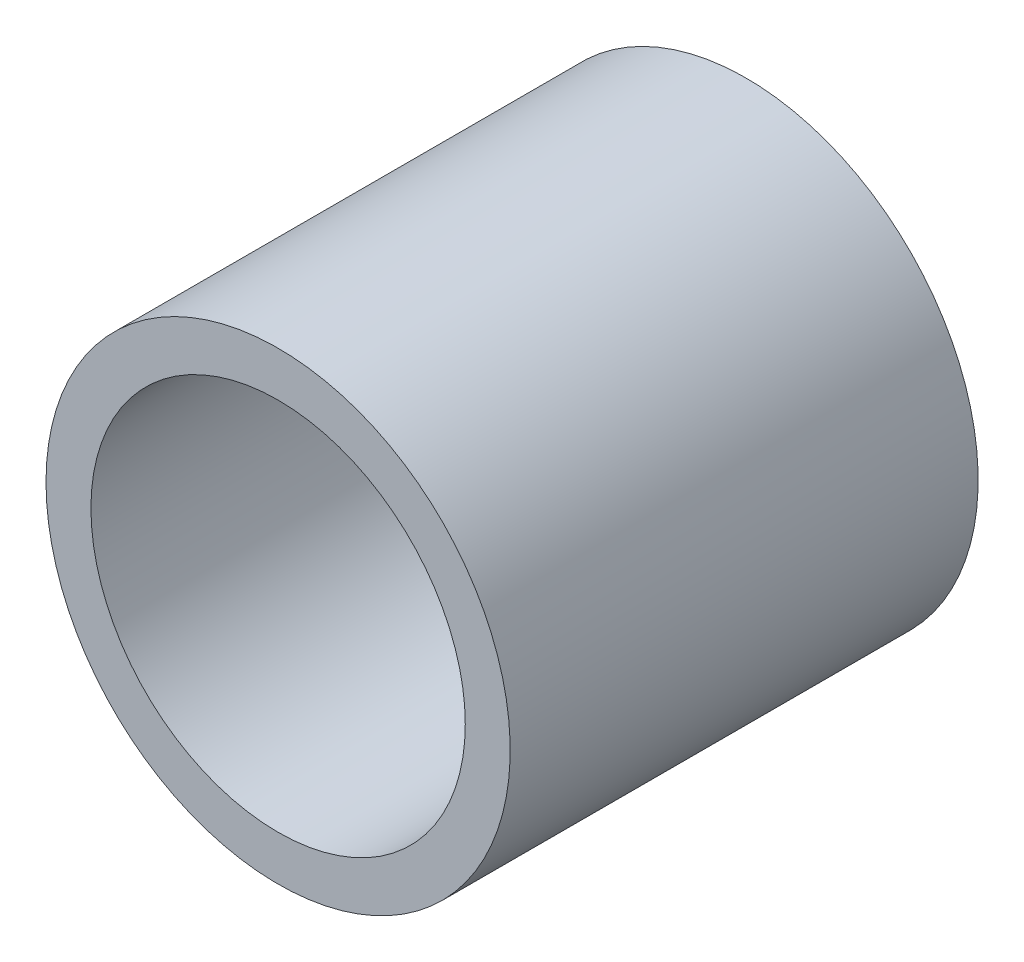
ISO-10303-21;
HEADER;
FILE_DESCRIPTION(('STEP AP214'),'2;1');
FILE_NAME('part.step','',(''),(''),'','','');
FILE_SCHEMA(('AUTOMOTIVE_DESIGN { 1 0 10303 214 1 1 1 1 }'));
ENDSEC;
DATA;
#1=APPLICATION_CONTEXT('core data for automotive mechanical design processes');
#2=APPLICATION_PROTOCOL_DEFINITION('international standard','automotive_design',2000,#1);
#3=PRODUCT_CONTEXT('',#1,'mechanical');
#4=PRODUCT('Part','Part','',(#3));
#5=PRODUCT_RELATED_PRODUCT_CATEGORY('part','',(#4));
#6=PRODUCT_DEFINITION_FORMATION('','',#4);
#7=PRODUCT_DEFINITION_CONTEXT('part definition',#1,'design');
#8=PRODUCT_DEFINITION('design','',#6,#7);
#9=PRODUCT_DEFINITION_SHAPE('','',#8);
#10=(LENGTH_UNIT() NAMED_UNIT(*) SI_UNIT(.MILLI.,.METRE.));
#11=(NAMED_UNIT(*) PLANE_ANGLE_UNIT() SI_UNIT($,.RADIAN.));
#12=(NAMED_UNIT(*) SI_UNIT($,.STERADIAN.) SOLID_ANGLE_UNIT());
#13=UNCERTAINTY_MEASURE_WITH_UNIT(LENGTH_MEASURE(1.E-05),#10,'distance_accuracy_value','');
#14=(GEOMETRIC_REPRESENTATION_CONTEXT(3) GLOBAL_UNCERTAINTY_ASSIGNED_CONTEXT((#13)) GLOBAL_UNIT_ASSIGNED_CONTEXT((#10,
#11,#12)) REPRESENTATION_CONTEXT('',''));
#15=CARTESIAN_POINT('',(0.,0.,0.));
#16=DIRECTION('',(0.,0.,1.));
#17=DIRECTION('',(1.,0.,0.));
#18=AXIS2_PLACEMENT_3D('',#15,#16,#17);
#19=CARTESIAN_POINT('',(0.,0.,15.875));
#20=DIRECTION('',(0.,0.,-1.));
#21=DIRECTION('',(-1.,0.,0.));
#22=AXIS2_PLACEMENT_3D('',#19,#20,#21);
#23=CYLINDRICAL_SURFACE('',#22,6.35);
#24=CARTESIAN_POINT('',(0.,0.,0.));
#25=DIRECTION('',(0.,0.,-1.));
#26=DIRECTION('',(-1.,0.,0.));
#27=AXIS2_PLACEMENT_3D('',#24,#25,#26);
#28=CIRCLE('',#27,6.35);
#29=CARTESIAN_POINT('',(-6.35,0.,0.));
#30=VERTEX_POINT('',#29);
#31=EDGE_CURVE('E27',#30,#30,#28,.T.);
#32=ORIENTED_EDGE('',*,*,#31,.T.);
#33=EDGE_LOOP('',(#32));
#34=FACE_BOUND('',#33,.T.);
#35=CARTESIAN_POINT('',(0.,0.,15.875));
#36=DIRECTION('',(0.,0.,-1.));
#37=DIRECTION('',(-1.,0.,0.));
#38=AXIS2_PLACEMENT_3D('',#35,#36,#37);
#39=CIRCLE('',#38,6.35);
#40=CARTESIAN_POINT('',(-6.35,0.,15.875));
#41=VERTEX_POINT('',#40);
#42=EDGE_CURVE('E18',#41,#41,#39,.T.);
#43=ORIENTED_EDGE('',*,*,#42,.F.);
#44=EDGE_LOOP('',(#43));
#45=FACE_BOUND('',#44,.T.);
#46=ADVANCED_FACE('F15',(#34,#45),#23,.F.);
#47=CARTESIAN_POINT('',(0.,0.,15.875));
#48=DIRECTION('',(0.,0.,1.));
#49=DIRECTION('',(1.,0.,0.));
#50=AXIS2_PLACEMENT_3D('',#47,#48,#49);
#51=PLANE('',#50);
#52=ORIENTED_EDGE('',*,*,#42,.T.);
#53=EDGE_LOOP('',(#52));
#54=FACE_BOUND('',#53,.T.);
#55=CARTESIAN_POINT('',(0.,0.,15.875));
#56=DIRECTION('',(0.,0.,-1.));
#57=DIRECTION('',(-1.,0.,0.));
#58=AXIS2_PLACEMENT_3D('',#55,#56,#57);
#59=CIRCLE('',#58,7.874);
#60=CARTESIAN_POINT('',(-7.874,0.,15.875));
#61=VERTEX_POINT('',#60);
#62=EDGE_CURVE('E22',#61,#61,#59,.T.);
#63=ORIENTED_EDGE('',*,*,#62,.F.);
#64=EDGE_LOOP('',(#63));
#65=FACE_BOUND('',#64,.T.);
#66=ADVANCED_FACE('F35',(#54,#65),#51,.T.);
#67=CARTESIAN_POINT('',(0.,0.,0.));
#68=DIRECTION('',(0.,0.,1.));
#69=DIRECTION('',(1.,0.,0.));
#70=AXIS2_PLACEMENT_3D('',#67,#68,#69);
#71=PLANE('',#70);
#72=ORIENTED_EDGE('',*,*,#31,.F.);
#73=EDGE_LOOP('',(#72));
#74=FACE_BOUND('',#73,.T.);
#75=CARTESIAN_POINT('',(0.,0.,0.));
#76=DIRECTION('',(0.,0.,-1.));
#77=DIRECTION('',(-1.,0.,0.));
#78=AXIS2_PLACEMENT_3D('',#75,#76,#77);
#79=CIRCLE('',#78,7.874);
#80=CARTESIAN_POINT('',(-7.874,0.,0.));
#81=VERTEX_POINT('',#80);
#82=EDGE_CURVE('E10',#81,#81,#79,.F.);
#83=ORIENTED_EDGE('',*,*,#82,.F.);
#84=EDGE_LOOP('',(#83));
#85=FACE_BOUND('',#84,.T.);
#86=ADVANCED_FACE('F43',(#74,#85),#71,.F.);
#87=CARTESIAN_POINT('',(0.,0.,15.875));
#88=DIRECTION('',(0.,0.,-1.));
#89=DIRECTION('',(-1.,0.,0.));
#90=AXIS2_PLACEMENT_3D('',#87,#88,#89);
#91=CYLINDRICAL_SURFACE('',#90,7.874);
#92=ORIENTED_EDGE('',*,*,#82,.T.);
#93=EDGE_LOOP('',(#92));
#94=FACE_BOUND('',#93,.T.);
#95=ORIENTED_EDGE('',*,*,#62,.T.);
#96=EDGE_LOOP('',(#95));
#97=FACE_BOUND('',#96,.T.);
#98=ADVANCED_FACE('F44',(#94,#97),#91,.T.);
#99=CLOSED_SHELL('',(#46,#66,#86,#98));
#100=MANIFOLD_SOLID_BREP('B1',#99);
#101=ADVANCED_BREP_SHAPE_REPRESENTATION('',(#18,#100),#14);
#102=SHAPE_DEFINITION_REPRESENTATION(#9,#101);
ENDSEC;
END-ISO-10303-21;
